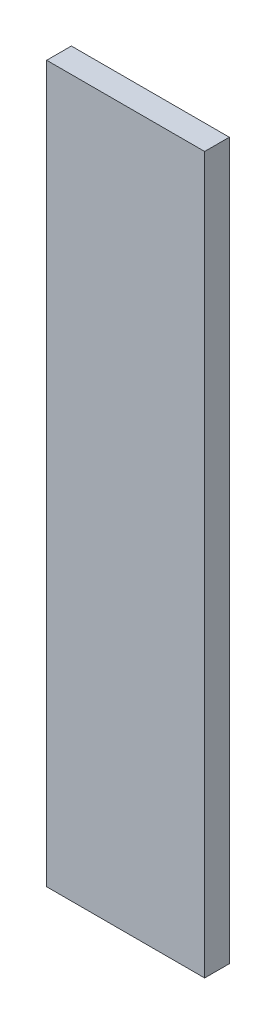
ISO-10303-21;
HEADER;
FILE_DESCRIPTION(('STEP AP214'),'2;1');
FILE_NAME('part.step','',(''),(''),'','','');
FILE_SCHEMA(('AUTOMOTIVE_DESIGN { 1 0 10303 214 1 1 1 1 }'));
ENDSEC;
DATA;
#1=APPLICATION_CONTEXT('core data for automotive mechanical design processes');
#2=APPLICATION_PROTOCOL_DEFINITION('international standard','automotive_design',2000,#1);
#3=PRODUCT_CONTEXT('',#1,'mechanical');
#4=PRODUCT('Part','Part','',(#3));
#5=PRODUCT_RELATED_PRODUCT_CATEGORY('part','',(#4));
#6=PRODUCT_DEFINITION_FORMATION('','',#4);
#7=PRODUCT_DEFINITION_CONTEXT('part definition',#1,'design');
#8=PRODUCT_DEFINITION('design','',#6,#7);
#9=PRODUCT_DEFINITION_SHAPE('','',#8);
#10=(LENGTH_UNIT() NAMED_UNIT(*) SI_UNIT(.MILLI.,.METRE.));
#11=(NAMED_UNIT(*) PLANE_ANGLE_UNIT() SI_UNIT($,.RADIAN.));
#12=(NAMED_UNIT(*) SI_UNIT($,.STERADIAN.) SOLID_ANGLE_UNIT());
#13=UNCERTAINTY_MEASURE_WITH_UNIT(LENGTH_MEASURE(1.E-05),#10,'distance_accuracy_value','');
#14=(GEOMETRIC_REPRESENTATION_CONTEXT(3) GLOBAL_UNCERTAINTY_ASSIGNED_CONTEXT((#13)) GLOBAL_UNIT_ASSIGNED_CONTEXT((#10,
#11,#12)) REPRESENTATION_CONTEXT('',''));
#15=CARTESIAN_POINT('',(0.,0.,0.));
#16=DIRECTION('',(0.,0.,1.));
#17=DIRECTION('',(1.,0.,0.));
#18=AXIS2_PLACEMENT_3D('',#15,#16,#17);
#19=CARTESIAN_POINT('',(48.,435.,7.5));
#20=DIRECTION('',(-1.,0.,0.));
#21=DIRECTION('',(0.,0.,1.));
#22=AXIS2_PLACEMENT_3D('',#19,#20,#21);
#23=PLANE('',#22);
#24=DIRECTION('',(0.,0.,-1.));
#25=VECTOR('',#24,1.);
#26=CARTESIAN_POINT('',(48.,0.,7.5));
#27=LINE('',#26,#25);
#28=CARTESIAN_POINT('',(48.,0.,7.5));
#29=VERTEX_POINT('',#28);
#30=CARTESIAN_POINT('',(48.,0.,-7.5));
#31=VERTEX_POINT('',#30);
#32=EDGE_CURVE('E96',#29,#31,#27,.T.);
#33=ORIENTED_EDGE('',*,*,#32,.T.);
#34=DIRECTION('',(0.,-1.,0.));
#35=VECTOR('',#34,1.);
#36=CARTESIAN_POINT('',(48.,435.,-7.5));
#37=LINE('',#36,#35);
#38=CARTESIAN_POINT('',(48.,435.,-7.5));
#39=VERTEX_POINT('',#38);
#40=EDGE_CURVE('E11',#39,#31,#37,.T.);
#41=ORIENTED_EDGE('',*,*,#40,.F.);
#42=DIRECTION('',(0.,0.,-1.));
#43=VECTOR('',#42,1.);
#44=CARTESIAN_POINT('',(48.,435.,7.5));
#45=LINE('',#44,#43);
#46=CARTESIAN_POINT('',(48.,435.,7.5));
#47=VERTEX_POINT('',#46);
#48=EDGE_CURVE('E84',#47,#39,#45,.T.);
#49=ORIENTED_EDGE('',*,*,#48,.F.);
#50=DIRECTION('',(0.,-1.,0.));
#51=VECTOR('',#50,1.);
#52=CARTESIAN_POINT('',(48.,435.,7.5));
#53=LINE('',#52,#51);
#54=EDGE_CURVE('E92',#47,#29,#53,.T.);
#55=ORIENTED_EDGE('',*,*,#54,.T.);
#56=EDGE_LOOP('',(#33,#41,#49,#55));
#57=FACE_BOUND('',#56,.T.);
#58=ADVANCED_FACE('F33',(#57),#23,.F.);
#59=CARTESIAN_POINT('',(-48.,435.,-7.5));
#60=DIRECTION('',(0.,0.,1.));
#61=DIRECTION('',(1.,0.,0.));
#62=AXIS2_PLACEMENT_3D('',#59,#60,#61);
#63=PLANE('',#62);
#64=DIRECTION('',(-1.,0.,0.));
#65=VECTOR('',#64,1.);
#66=CARTESIAN_POINT('',(-48.,0.,-7.5));
#67=LINE('',#66,#65);
#68=CARTESIAN_POINT('',(-48.,0.,-7.5));
#69=VERTEX_POINT('',#68);
#70=EDGE_CURVE('E88',#31,#69,#67,.T.);
#71=ORIENTED_EDGE('',*,*,#70,.T.);
#72=DIRECTION('',(0.,-1.,0.));
#73=VECTOR('',#72,1.);
#74=CARTESIAN_POINT('',(-48.,435.,-7.5));
#75=LINE('',#74,#73);
#76=CARTESIAN_POINT('',(-48.,435.,-7.5));
#77=VERTEX_POINT('',#76);
#78=EDGE_CURVE('E41',#77,#69,#75,.T.);
#79=ORIENTED_EDGE('',*,*,#78,.F.);
#80=DIRECTION('',(-1.,0.,0.));
#81=VECTOR('',#80,1.);
#82=CARTESIAN_POINT('',(-48.,435.,-7.5));
#83=LINE('',#82,#81);
#84=EDGE_CURVE('E79',#39,#77,#83,.T.);
#85=ORIENTED_EDGE('',*,*,#84,.F.);
#86=ORIENTED_EDGE('',*,*,#40,.T.);
#87=EDGE_LOOP('',(#71,#79,#85,#86));
#88=FACE_BOUND('',#87,.T.);
#89=ADVANCED_FACE('F87',(#88),#63,.F.);
#90=CARTESIAN_POINT('',(-48.,435.,7.5));
#91=DIRECTION('',(1.,0.,0.));
#92=DIRECTION('',(0.,0.,-1.));
#93=AXIS2_PLACEMENT_3D('',#90,#91,#92);
#94=PLANE('',#93);
#95=DIRECTION('',(0.,0.,1.));
#96=VECTOR('',#95,1.);
#97=CARTESIAN_POINT('',(-48.,0.,7.5));
#98=LINE('',#97,#96);
#99=CARTESIAN_POINT('',(-48.,0.,7.5));
#100=VERTEX_POINT('',#99);
#101=EDGE_CURVE('E66',#69,#100,#98,.T.);
#102=ORIENTED_EDGE('',*,*,#101,.T.);
#103=DIRECTION('',(0.,-1.,0.));
#104=VECTOR('',#103,1.);
#105=CARTESIAN_POINT('',(-48.,435.,7.5));
#106=LINE('',#105,#104);
#107=CARTESIAN_POINT('',(-48.,435.,7.5));
#108=VERTEX_POINT('',#107);
#109=EDGE_CURVE('E89',#108,#100,#106,.T.);
#110=ORIENTED_EDGE('',*,*,#109,.F.);
#111=DIRECTION('',(0.,0.,1.));
#112=VECTOR('',#111,1.);
#113=CARTESIAN_POINT('',(-48.,435.,7.5));
#114=LINE('',#113,#112);
#115=EDGE_CURVE('E82',#77,#108,#114,.T.);
#116=ORIENTED_EDGE('',*,*,#115,.F.);
#117=ORIENTED_EDGE('',*,*,#78,.T.);
#118=EDGE_LOOP('',(#102,#110,#116,#117));
#119=FACE_BOUND('',#118,.T.);
#120=ADVANCED_FACE('F90',(#119),#94,.F.);
#121=CARTESIAN_POINT('',(-48.,435.,7.5));
#122=DIRECTION('',(0.,0.,-1.));
#123=DIRECTION('',(-1.,0.,0.));
#124=AXIS2_PLACEMENT_3D('',#121,#122,#123);
#125=PLANE('',#124);
#126=DIRECTION('',(1.,0.,0.));
#127=VECTOR('',#126,1.);
#128=CARTESIAN_POINT('',(-48.,0.,7.5));
#129=LINE('',#128,#127);
#130=EDGE_CURVE('E72',#100,#29,#129,.T.);
#131=ORIENTED_EDGE('',*,*,#130,.T.);
#132=ORIENTED_EDGE('',*,*,#54,.F.);
#133=DIRECTION('',(1.,0.,0.));
#134=VECTOR('',#133,1.);
#135=CARTESIAN_POINT('',(-48.,435.,7.5));
#136=LINE('',#135,#134);
#137=EDGE_CURVE('E49',#108,#47,#136,.T.);
#138=ORIENTED_EDGE('',*,*,#137,.F.);
#139=ORIENTED_EDGE('',*,*,#109,.T.);
#140=EDGE_LOOP('',(#131,#132,#138,#139));
#141=FACE_BOUND('',#140,.T.);
#142=ADVANCED_FACE('F103',(#141),#125,.F.);
#143=CARTESIAN_POINT('',(0.,435.,0.));
#144=DIRECTION('',(0.,-1.,0.));
#145=DIRECTION('',(0.,0.,-1.));
#146=AXIS2_PLACEMENT_3D('',#143,#144,#145);
#147=PLANE('',#146);
#148=ORIENTED_EDGE('',*,*,#48,.T.);
#149=ORIENTED_EDGE('',*,*,#84,.T.);
#150=ORIENTED_EDGE('',*,*,#115,.T.);
#151=ORIENTED_EDGE('',*,*,#137,.T.);
#152=EDGE_LOOP('',(#148,#149,#150,#151));
#153=FACE_BOUND('',#152,.T.);
#154=ADVANCED_FACE('F80',(#153),#147,.F.);
#155=CARTESIAN_POINT('',(0.,0.,0.));
#156=DIRECTION('',(0.,-1.,0.));
#157=DIRECTION('',(0.,0.,-1.));
#158=AXIS2_PLACEMENT_3D('',#155,#156,#157);
#159=PLANE('',#158);
#160=ORIENTED_EDGE('',*,*,#32,.F.);
#161=ORIENTED_EDGE('',*,*,#130,.F.);
#162=ORIENTED_EDGE('',*,*,#101,.F.);
#163=ORIENTED_EDGE('',*,*,#70,.F.);
#164=EDGE_LOOP('',(#160,#161,#162,#163));
#165=FACE_BOUND('',#164,.T.);
#166=ADVANCED_FACE('F106',(#165),#159,.T.);
#167=CLOSED_SHELL('',(#58,#89,#120,#142,#154,#166));
#168=MANIFOLD_SOLID_BREP('B2',#167);
#169=ADVANCED_BREP_SHAPE_REPRESENTATION('',(#18,#168),#14);
#170=SHAPE_DEFINITION_REPRESENTATION(#9,#169);
ENDSEC;
END-ISO-10303-21;
